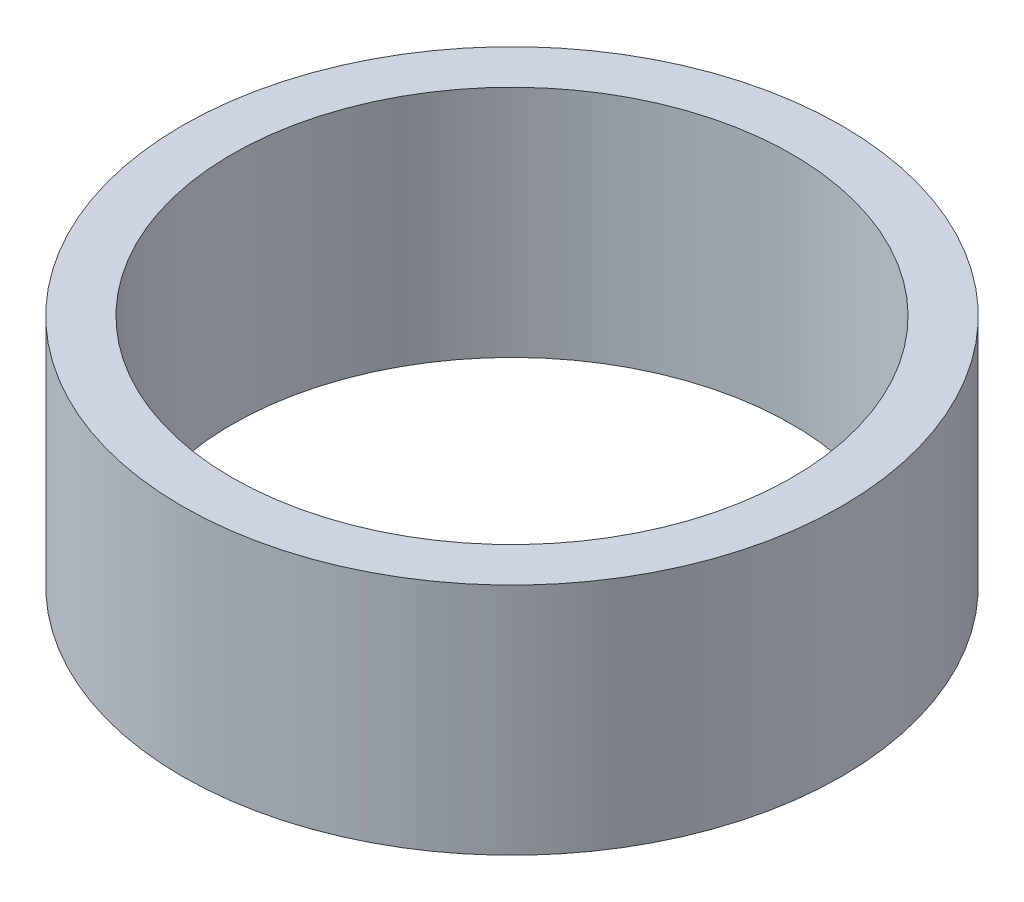
ISO-10303-21;
HEADER;
FILE_DESCRIPTION(('STEP AP214'),'2;1');
FILE_NAME('part.step','',(''),(''),'','','');
FILE_SCHEMA(('AUTOMOTIVE_DESIGN { 1 0 10303 214 1 1 1 1 }'));
ENDSEC;
DATA;
#1=APPLICATION_CONTEXT('core data for automotive mechanical design processes');
#2=APPLICATION_PROTOCOL_DEFINITION('international standard','automotive_design',2000,#1);
#3=PRODUCT_CONTEXT('',#1,'mechanical');
#4=PRODUCT('Part','Part','',(#3));
#5=PRODUCT_RELATED_PRODUCT_CATEGORY('part','',(#4));
#6=PRODUCT_DEFINITION_FORMATION('','',#4);
#7=PRODUCT_DEFINITION_CONTEXT('part definition',#1,'design');
#8=PRODUCT_DEFINITION('design','',#6,#7);
#9=PRODUCT_DEFINITION_SHAPE('','',#8);
#10=(LENGTH_UNIT() NAMED_UNIT(*) SI_UNIT(.MILLI.,.METRE.));
#11=(NAMED_UNIT(*) PLANE_ANGLE_UNIT() SI_UNIT($,.RADIAN.));
#12=(NAMED_UNIT(*) SI_UNIT($,.STERADIAN.) SOLID_ANGLE_UNIT());
#13=UNCERTAINTY_MEASURE_WITH_UNIT(LENGTH_MEASURE(1.E-05),#10,'distance_accuracy_value','');
#14=(GEOMETRIC_REPRESENTATION_CONTEXT(3) GLOBAL_UNCERTAINTY_ASSIGNED_CONTEXT((#13)) GLOBAL_UNIT_ASSIGNED_CONTEXT((#10,
#11,#12)) REPRESENTATION_CONTEXT('',''));
#15=CARTESIAN_POINT('',(0.,0.,0.));
#16=DIRECTION('',(0.,0.,1.));
#17=DIRECTION('',(1.,0.,0.));
#18=AXIS2_PLACEMENT_3D('',#15,#16,#17);
#19=CARTESIAN_POINT('',(0.,16.5,0.));
#20=DIRECTION('',(0.,-1.,0.));
#21=DIRECTION('',(0.,0.,-1.));
#22=AXIS2_PLACEMENT_3D('',#19,#20,#21);
#23=CYLINDRICAL_SURFACE('',#22,23.25);
#24=CARTESIAN_POINT('',(0.,16.5,0.));
#25=DIRECTION('',(0.,1.,0.));
#26=DIRECTION('',(0.,0.,1.));
#27=AXIS2_PLACEMENT_3D('',#24,#25,#26);
#28=CIRCLE('',#27,23.25);
#29=CARTESIAN_POINT('',(0.,16.5,23.25));
#30=VERTEX_POINT('',#29);
#31=EDGE_CURVE('E10',#30,#30,#28,.T.);
#32=ORIENTED_EDGE('',*,*,#31,.F.);
#33=EDGE_LOOP('',(#32));
#34=FACE_BOUND('',#33,.T.);
#35=CARTESIAN_POINT('',(0.,0.,0.));
#36=DIRECTION('',(0.,1.,0.));
#37=DIRECTION('',(0.,0.,1.));
#38=AXIS2_PLACEMENT_3D('',#35,#36,#37);
#39=CIRCLE('',#38,23.25);
#40=CARTESIAN_POINT('',(0.,0.,23.25));
#41=VERTEX_POINT('',#40);
#42=EDGE_CURVE('E42',#41,#41,#39,.T.);
#43=ORIENTED_EDGE('',*,*,#42,.T.);
#44=EDGE_LOOP('',(#43));
#45=FACE_BOUND('',#44,.T.);
#46=ADVANCED_FACE('F39',(#34,#45),#23,.T.);
#47=CARTESIAN_POINT('',(0.,16.5,0.));
#48=DIRECTION('',(0.,1.,0.));
#49=DIRECTION('',(0.,0.,1.));
#50=AXIS2_PLACEMENT_3D('',#47,#48,#49);
#51=PLANE('',#50);
#52=CARTESIAN_POINT('',(0.,16.5,0.));
#53=DIRECTION('',(0.,1.,0.));
#54=DIRECTION('',(0.,0.,1.));
#55=AXIS2_PLACEMENT_3D('',#52,#53,#54);
#56=CIRCLE('',#55,19.75);
#57=CARTESIAN_POINT('',(0.,16.5,19.75));
#58=VERTEX_POINT('',#57);
#59=EDGE_CURVE('E53',#58,#58,#56,.T.);
#60=ORIENTED_EDGE('',*,*,#59,.F.);
#61=EDGE_LOOP('',(#60));
#62=FACE_BOUND('',#61,.T.);
#63=ORIENTED_EDGE('',*,*,#31,.T.);
#64=EDGE_LOOP('',(#63));
#65=FACE_BOUND('',#64,.T.);
#66=ADVANCED_FACE('F70',(#62,#65),#51,.T.);
#67=CARTESIAN_POINT('',(0.,0.,0.));
#68=DIRECTION('',(0.,1.,0.));
#69=DIRECTION('',(0.,0.,1.));
#70=AXIS2_PLACEMENT_3D('',#67,#68,#69);
#71=PLANE('',#70);
#72=CARTESIAN_POINT('',(0.,0.,0.));
#73=DIRECTION('',(0.,1.,0.));
#74=DIRECTION('',(0.,0.,1.));
#75=AXIS2_PLACEMENT_3D('',#72,#73,#74);
#76=CIRCLE('',#75,19.75);
#77=CARTESIAN_POINT('',(0.,0.,19.75));
#78=VERTEX_POINT('',#77);
#79=EDGE_CURVE('E51',#78,#78,#76,.T.);
#80=ORIENTED_EDGE('',*,*,#79,.T.);
#81=EDGE_LOOP('',(#80));
#82=FACE_BOUND('',#81,.T.);
#83=ORIENTED_EDGE('',*,*,#42,.F.);
#84=EDGE_LOOP('',(#83));
#85=FACE_BOUND('',#84,.T.);
#86=ADVANCED_FACE('F61',(#82,#85),#71,.F.);
#87=CARTESIAN_POINT('',(0.,0.,0.));
#88=DIRECTION('',(0.,1.,0.));
#89=DIRECTION('',(0.,0.,1.));
#90=AXIS2_PLACEMENT_3D('',#87,#88,#89);
#91=CYLINDRICAL_SURFACE('',#90,19.75);
#92=ORIENTED_EDGE('',*,*,#79,.F.);
#93=EDGE_LOOP('',(#92));
#94=FACE_BOUND('',#93,.T.);
#95=ORIENTED_EDGE('',*,*,#59,.T.);
#96=EDGE_LOOP('',(#95));
#97=FACE_BOUND('',#96,.T.);
#98=ADVANCED_FACE('F64',(#94,#97),#91,.F.);
#99=CLOSED_SHELL('',(#46,#66,#86,#98));
#100=MANIFOLD_SOLID_BREP('B2',#99);
#101=ADVANCED_BREP_SHAPE_REPRESENTATION('',(#18,#100),#14);
#102=SHAPE_DEFINITION_REPRESENTATION(#9,#101);
ENDSEC;
END-ISO-10303-21;
